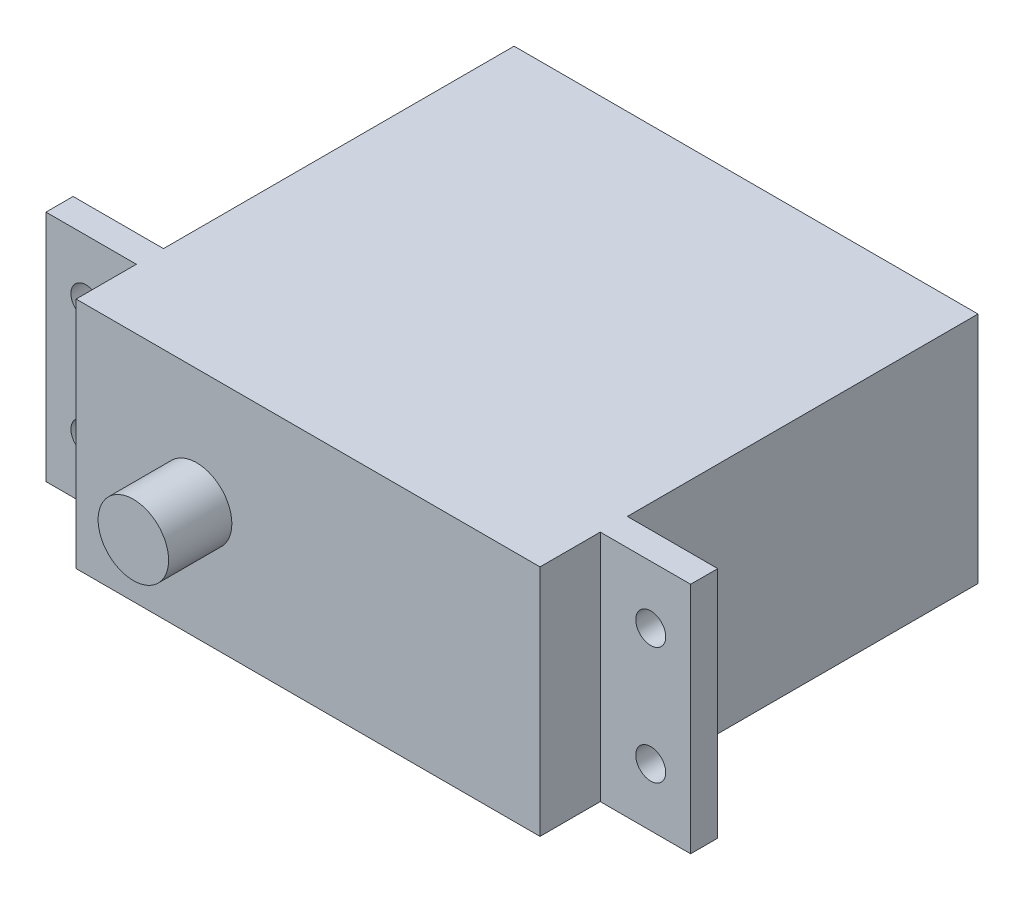
ISO-10303-21;
HEADER;
FILE_DESCRIPTION(('STEP AP214'),'2;1');
FILE_NAME('part.step','',(''),(''),'','','');
FILE_SCHEMA(('AUTOMOTIVE_DESIGN { 1 0 10303 214 1 1 1 1 }'));
ENDSEC;
DATA;
#1=APPLICATION_CONTEXT('core data for automotive mechanical design processes');
#2=APPLICATION_PROTOCOL_DEFINITION('international standard','automotive_design',2000,#1);
#3=PRODUCT_CONTEXT('',#1,'mechanical');
#4=PRODUCT('Part','Part','',(#3));
#5=PRODUCT_RELATED_PRODUCT_CATEGORY('part','',(#4));
#6=PRODUCT_DEFINITION_FORMATION('','',#4);
#7=PRODUCT_DEFINITION_CONTEXT('part definition',#1,'design');
#8=PRODUCT_DEFINITION('design','',#6,#7);
#9=PRODUCT_DEFINITION_SHAPE('','',#8);
#10=(LENGTH_UNIT() NAMED_UNIT(*) SI_UNIT(.MILLI.,.METRE.));
#11=(NAMED_UNIT(*) PLANE_ANGLE_UNIT() SI_UNIT($,.RADIAN.));
#12=(NAMED_UNIT(*) SI_UNIT($,.STERADIAN.) SOLID_ANGLE_UNIT());
#13=UNCERTAINTY_MEASURE_WITH_UNIT(LENGTH_MEASURE(1.E-05),#10,'distance_accuracy_value','');
#14=(GEOMETRIC_REPRESENTATION_CONTEXT(3) GLOBAL_UNCERTAINTY_ASSIGNED_CONTEXT((#13)) GLOBAL_UNIT_ASSIGNED_CONTEXT((#10,
#11,#12)) REPRESENTATION_CONTEXT('',''));
#15=CARTESIAN_POINT('',(0.,0.,0.));
#16=DIRECTION('',(0.,0.,1.));
#17=DIRECTION('',(1.,0.,0.));
#18=AXIS2_PLACEMENT_3D('',#15,#16,#17);
#19=CARTESIAN_POINT('',(-27.178,-9.8425,42.2656));
#20=DIRECTION('',(1.,0.,0.));
#21=DIRECTION('',(0.,1.,0.));
#22=AXIS2_PLACEMENT_3D('',#19,#20,#21);
#23=PLANE('',#22);
#24=DIRECTION('',(0.,1.,0.));
#25=VECTOR('',#24,1.);
#26=CARTESIAN_POINT('',(-27.178,9.89648854594805,29.5656));
#27=LINE('',#26,#25);
#28=CARTESIAN_POINT('',(-27.178,-9.8425,29.5656));
#29=VERTEX_POINT('',#28);
#30=CARTESIAN_POINT('',(-27.178,9.8425,29.5656));
#31=VERTEX_POINT('',#30);
#32=EDGE_CURVE('E204',#29,#31,#27,.T.);
#33=ORIENTED_EDGE('',*,*,#32,.F.);
#34=DIRECTION('',(0.,0.,-1.));
#35=VECTOR('',#34,1.);
#36=CARTESIAN_POINT('',(-27.178,-9.8425,42.2656));
#37=LINE('',#36,#35);
#38=CARTESIAN_POINT('',(-27.178,-9.8425,31.8516));
#39=VERTEX_POINT('',#38);
#40=EDGE_CURVE('E148',#39,#29,#37,.T.);
#41=ORIENTED_EDGE('',*,*,#40,.F.);
#42=DIRECTION('',(0.,-1.,0.));
#43=VECTOR('',#42,1.);
#44=CARTESIAN_POINT('',(-27.178,-9.95965837324774,31.8516));
#45=LINE('',#44,#43);
#46=CARTESIAN_POINT('',(-27.178,9.8425,31.8516));
#47=VERTEX_POINT('',#46);
#48=EDGE_CURVE('E216',#47,#39,#45,.T.);
#49=ORIENTED_EDGE('',*,*,#48,.F.);
#50=DIRECTION('',(0.,0.,-1.));
#51=VECTOR('',#50,1.);
#52=CARTESIAN_POINT('',(-27.178,9.8425,42.2656));
#53=LINE('',#52,#51);
#54=EDGE_CURVE('E146',#47,#31,#53,.T.);
#55=ORIENTED_EDGE('',*,*,#54,.T.);
#56=EDGE_LOOP('',(#33,#41,#49,#55));
#57=FACE_BOUND('',#56,.T.);
#58=ADVANCED_FACE('F34',(#57),#23,.F.);
#59=CARTESIAN_POINT('',(-27.178,-9.8425,42.2656));
#60=DIRECTION('',(0.,1.,0.));
#61=DIRECTION('',(0.,0.,1.));
#62=AXIS2_PLACEMENT_3D('',#59,#60,#61);
#63=PLANE('',#62);
#64=DIRECTION('',(1.,0.,0.));
#65=VECTOR('',#64,1.);
#66=CARTESIAN_POINT('',(-27.178,-9.8425,0.));
#67=LINE('',#66,#65);
#68=CARTESIAN_POINT('',(-19.558,-9.8425,0.));
#69=VERTEX_POINT('',#68);
#70=CARTESIAN_POINT('',(19.558,-9.8425,0.));
#71=VERTEX_POINT('',#70);
#72=EDGE_CURVE('E247',#69,#71,#67,.T.);
#73=ORIENTED_EDGE('',*,*,#72,.T.);
#74=DIRECTION('',(0.,0.,1.));
#75=VECTOR('',#74,1.);
#76=CARTESIAN_POINT('',(19.558,-9.8425,42.2656));
#77=LINE('',#76,#75);
#78=CARTESIAN_POINT('',(19.558,-9.8425,29.5656));
#79=VERTEX_POINT('',#78);
#80=EDGE_CURVE('E50',#71,#79,#77,.T.);
#81=ORIENTED_EDGE('',*,*,#80,.T.);
#82=DIRECTION('',(1.,0.,0.));
#83=VECTOR('',#82,1.);
#84=CARTESIAN_POINT('',(-27.178,-9.8425,29.5656));
#85=LINE('',#84,#83);
#86=CARTESIAN_POINT('',(27.178,-9.8425,29.5656));
#87=VERTEX_POINT('',#86);
#88=EDGE_CURVE('E199',#79,#87,#85,.T.);
#89=ORIENTED_EDGE('',*,*,#88,.T.);
#90=DIRECTION('',(0.,0.,-1.));
#91=VECTOR('',#90,1.);
#92=CARTESIAN_POINT('',(27.178,-9.8425,42.2656));
#93=LINE('',#92,#91);
#94=CARTESIAN_POINT('',(27.178,-9.8425,31.8516));
#95=VERTEX_POINT('',#94);
#96=EDGE_CURVE('E139',#95,#87,#93,.T.);
#97=ORIENTED_EDGE('',*,*,#96,.F.);
#98=DIRECTION('',(-1.,0.,0.));
#99=VECTOR('',#98,1.);
#100=CARTESIAN_POINT('',(-27.178,-9.8425,31.8516));
#101=LINE('',#100,#99);
#102=CARTESIAN_POINT('',(19.558,-9.8425,31.8516));
#103=VERTEX_POINT('',#102);
#104=EDGE_CURVE('E236',#95,#103,#101,.T.);
#105=ORIENTED_EDGE('',*,*,#104,.T.);
#106=DIRECTION('',(0.,0.,1.));
#107=VECTOR('',#106,1.);
#108=CARTESIAN_POINT('',(19.558,-9.8425,42.2656));
#109=LINE('',#108,#107);
#110=CARTESIAN_POINT('',(19.558,-9.8425,36.9316));
#111=VERTEX_POINT('',#110);
#112=EDGE_CURVE('E233',#103,#111,#109,.T.);
#113=ORIENTED_EDGE('',*,*,#112,.T.);
#114=DIRECTION('',(1.,0.,0.));
#115=VECTOR('',#114,1.);
#116=CARTESIAN_POINT('',(-27.178,-9.8425,36.9316));
#117=LINE('',#116,#115);
#118=CARTESIAN_POINT('',(-19.558,-9.8425,36.9316));
#119=VERTEX_POINT('',#118);
#120=EDGE_CURVE('E243',#119,#111,#117,.T.);
#121=ORIENTED_EDGE('',*,*,#120,.F.);
#122=DIRECTION('',(0.,0.,-1.));
#123=VECTOR('',#122,1.);
#124=CARTESIAN_POINT('',(-19.558,-9.8425,42.2656));
#125=LINE('',#124,#123);
#126=CARTESIAN_POINT('',(-19.558,-9.8425,31.8516));
#127=VERTEX_POINT('',#126);
#128=EDGE_CURVE('E221',#119,#127,#125,.T.);
#129=ORIENTED_EDGE('',*,*,#128,.T.);
#130=DIRECTION('',(1.,0.,0.));
#131=VECTOR('',#130,1.);
#132=CARTESIAN_POINT('',(-27.178,-9.8425,31.8516));
#133=LINE('',#132,#131);
#134=EDGE_CURVE('E224',#39,#127,#133,.T.);
#135=ORIENTED_EDGE('',*,*,#134,.F.);
#136=ORIENTED_EDGE('',*,*,#40,.T.);
#137=DIRECTION('',(-1.,0.,0.));
#138=VECTOR('',#137,1.);
#139=CARTESIAN_POINT('',(-27.178,-9.8425,29.5656));
#140=LINE('',#139,#138);
#141=CARTESIAN_POINT('',(-19.558,-9.8425,29.5656));
#142=VERTEX_POINT('',#141);
#143=EDGE_CURVE('E211',#142,#29,#140,.T.);
#144=ORIENTED_EDGE('',*,*,#143,.F.);
#145=DIRECTION('',(0.,0.,-1.));
#146=VECTOR('',#145,1.);
#147=CARTESIAN_POINT('',(-19.558,-9.8425,42.2656));
#148=LINE('',#147,#146);
#149=EDGE_CURVE('E208',#142,#69,#148,.T.);
#150=ORIENTED_EDGE('',*,*,#149,.T.);
#151=EDGE_LOOP('',(#73,#81,#89,#97,#105,#113,#121,#129,#135,#136,#144,#150));
#152=FACE_BOUND('',#151,.T.);
#153=ADVANCED_FACE('F251',(#152),#63,.F.);
#154=CARTESIAN_POINT('',(27.178,-9.8425,42.2656));
#155=DIRECTION('',(-1.,0.,0.));
#156=DIRECTION('',(0.,-1.,0.));
#157=AXIS2_PLACEMENT_3D('',#154,#155,#156);
#158=PLANE('',#157);
#159=ORIENTED_EDGE('',*,*,#96,.T.);
#160=DIRECTION('',(0.,-1.,0.));
#161=VECTOR('',#160,1.);
#162=CARTESIAN_POINT('',(27.178,9.9934184525239,29.5656));
#163=LINE('',#162,#161);
#164=CARTESIAN_POINT('',(27.178,9.84250000000001,29.5656));
#165=VERTEX_POINT('',#164);
#166=EDGE_CURVE('E128',#165,#87,#163,.T.);
#167=ORIENTED_EDGE('',*,*,#166,.F.);
#168=DIRECTION('',(0.,0.,-1.));
#169=VECTOR('',#168,1.);
#170=CARTESIAN_POINT('',(27.178,9.84250000000001,42.2656));
#171=LINE('',#170,#169);
#172=CARTESIAN_POINT('',(27.178,9.84250000000001,31.8516));
#173=VERTEX_POINT('',#172);
#174=EDGE_CURVE('E137',#173,#165,#171,.T.);
#175=ORIENTED_EDGE('',*,*,#174,.F.);
#176=DIRECTION('',(0.,1.,0.));
#177=VECTOR('',#176,1.);
#178=CARTESIAN_POINT('',(27.178,-10.1678865434564,31.8516));
#179=LINE('',#178,#177);
#180=EDGE_CURVE('E229',#95,#173,#179,.T.);
#181=ORIENTED_EDGE('',*,*,#180,.F.);
#182=EDGE_LOOP('',(#159,#167,#175,#181));
#183=FACE_BOUND('',#182,.T.);
#184=ADVANCED_FACE('F135',(#183),#158,.F.);
#185=CARTESIAN_POINT('',(-27.178,9.8425,42.2656));
#186=DIRECTION('',(0.,-1.,0.));
#187=DIRECTION('',(1.,0.,0.));
#188=AXIS2_PLACEMENT_3D('',#185,#186,#187);
#189=PLANE('',#188);
#190=DIRECTION('',(-1.,0.,0.));
#191=VECTOR('',#190,1.);
#192=CARTESIAN_POINT('',(-27.178,9.8425,29.5656));
#193=LINE('',#192,#191);
#194=CARTESIAN_POINT('',(19.558,9.84250000000001,29.5656));
#195=VERTEX_POINT('',#194);
#196=EDGE_CURVE('E12',#165,#195,#193,.T.);
#197=ORIENTED_EDGE('',*,*,#196,.T.);
#198=DIRECTION('',(0.,0.,-1.));
#199=VECTOR('',#198,1.);
#200=CARTESIAN_POINT('',(19.558,9.84250000000001,42.2656));
#201=LINE('',#200,#199);
#202=CARTESIAN_POINT('',(19.558,9.84250000000001,0.));
#203=VERTEX_POINT('',#202);
#204=EDGE_CURVE('E140',#195,#203,#201,.T.);
#205=ORIENTED_EDGE('',*,*,#204,.T.);
#206=DIRECTION('',(-1.,0.,0.));
#207=VECTOR('',#206,1.);
#208=CARTESIAN_POINT('',(-27.178,9.8425,0.));
#209=LINE('',#208,#207);
#210=CARTESIAN_POINT('',(-19.558,9.8425,0.));
#211=VERTEX_POINT('',#210);
#212=EDGE_CURVE('E58',#203,#211,#209,.T.);
#213=ORIENTED_EDGE('',*,*,#212,.T.);
#214=DIRECTION('',(0.,0.,1.));
#215=VECTOR('',#214,1.);
#216=CARTESIAN_POINT('',(-19.558,9.8425,42.2656));
#217=LINE('',#216,#215);
#218=CARTESIAN_POINT('',(-19.558,9.8425,29.5656));
#219=VERTEX_POINT('',#218);
#220=EDGE_CURVE('E206',#211,#219,#217,.T.);
#221=ORIENTED_EDGE('',*,*,#220,.T.);
#222=DIRECTION('',(1.,0.,0.));
#223=VECTOR('',#222,1.);
#224=CARTESIAN_POINT('',(-27.178,9.8425,29.5656));
#225=LINE('',#224,#223);
#226=EDGE_CURVE('E169',#31,#219,#225,.T.);
#227=ORIENTED_EDGE('',*,*,#226,.F.);
#228=ORIENTED_EDGE('',*,*,#54,.F.);
#229=DIRECTION('',(-1.,0.,0.));
#230=VECTOR('',#229,1.);
#231=CARTESIAN_POINT('',(-27.178,9.8425,31.8516));
#232=LINE('',#231,#230);
#233=CARTESIAN_POINT('',(-19.558,9.8425,31.8516));
#234=VERTEX_POINT('',#233);
#235=EDGE_CURVE('E165',#234,#47,#232,.T.);
#236=ORIENTED_EDGE('',*,*,#235,.F.);
#237=DIRECTION('',(0.,0.,1.));
#238=VECTOR('',#237,1.);
#239=CARTESIAN_POINT('',(-19.558,9.8425,42.2656));
#240=LINE('',#239,#238);
#241=CARTESIAN_POINT('',(-19.558,9.84250000000001,36.9316));
#242=VERTEX_POINT('',#241);
#243=EDGE_CURVE('E218',#234,#242,#240,.T.);
#244=ORIENTED_EDGE('',*,*,#243,.T.);
#245=DIRECTION('',(-1.,0.,0.));
#246=VECTOR('',#245,1.);
#247=CARTESIAN_POINT('',(-27.178,9.8425,36.9316));
#248=LINE('',#247,#246);
#249=CARTESIAN_POINT('',(19.558,9.84250000000001,36.9316));
#250=VERTEX_POINT('',#249);
#251=EDGE_CURVE('E156',#250,#242,#248,.T.);
#252=ORIENTED_EDGE('',*,*,#251,.F.);
#253=DIRECTION('',(0.,0.,-1.));
#254=VECTOR('',#253,1.);
#255=CARTESIAN_POINT('',(19.558,9.84250000000001,42.2656));
#256=LINE('',#255,#254);
#257=CARTESIAN_POINT('',(19.558,9.84250000000001,31.8516));
#258=VERTEX_POINT('',#257);
#259=EDGE_CURVE('E231',#250,#258,#256,.T.);
#260=ORIENTED_EDGE('',*,*,#259,.T.);
#261=DIRECTION('',(1.,0.,0.));
#262=VECTOR('',#261,1.);
#263=CARTESIAN_POINT('',(-27.178,9.8425,31.8516));
#264=LINE('',#263,#262);
#265=EDGE_CURVE('E145',#258,#173,#264,.T.);
#266=ORIENTED_EDGE('',*,*,#265,.T.);
#267=ORIENTED_EDGE('',*,*,#174,.T.);
#268=EDGE_LOOP('',(#197,#205,#213,#221,#227,#228,#236,#244,#252,#260,#266,#267));
#269=FACE_BOUND('',#268,.T.);
#270=ADVANCED_FACE('F143',(#269),#189,.F.);
#271=CARTESIAN_POINT('',(-27.178,9.8425,0.));
#272=DIRECTION('',(0.,0.,-1.));
#273=DIRECTION('',(-1.,0.,0.));
#274=AXIS2_PLACEMENT_3D('',#271,#272,#273);
#275=PLANE('',#274);
#276=DIRECTION('',(0.,1.,0.));
#277=VECTOR('',#276,1.);
#278=CARTESIAN_POINT('',(19.558,9.84250000000004,0.));
#279=LINE('',#278,#277);
#280=EDGE_CURVE('E42',#71,#203,#279,.T.);
#281=ORIENTED_EDGE('',*,*,#280,.F.);
#282=ORIENTED_EDGE('',*,*,#72,.F.);
#283=DIRECTION('',(0.,-1.,0.));
#284=VECTOR('',#283,1.);
#285=CARTESIAN_POINT('',(-19.558,9.8425,0.));
#286=LINE('',#285,#284);
#287=EDGE_CURVE('E167',#211,#69,#286,.T.);
#288=ORIENTED_EDGE('',*,*,#287,.F.);
#289=ORIENTED_EDGE('',*,*,#212,.F.);
#290=EDGE_LOOP('',(#281,#282,#288,#289));
#291=FACE_BOUND('',#290,.T.);
#292=ADVANCED_FACE('F255',(#291),#275,.T.);
#293=CARTESIAN_POINT('',(0.,0.,36.9316));
#294=DIRECTION('',(0.,0.,1.));
#295=DIRECTION('',(1.,0.,0.));
#296=AXIS2_PLACEMENT_3D('',#293,#294,#295);
#297=PLANE('',#296);
#298=DIRECTION('',(0.,1.,0.));
#299=VECTOR('',#298,1.);
#300=CARTESIAN_POINT('',(-19.558,0.,36.9316));
#301=LINE('',#300,#299);
#302=EDGE_CURVE('E163',#119,#242,#301,.T.);
#303=ORIENTED_EDGE('',*,*,#302,.F.);
#304=ORIENTED_EDGE('',*,*,#120,.T.);
#305=DIRECTION('',(0.,-1.,0.));
#306=VECTOR('',#305,1.);
#307=CARTESIAN_POINT('',(19.558,0.,36.9316));
#308=LINE('',#307,#306);
#309=EDGE_CURVE('E159',#250,#111,#308,.T.);
#310=ORIENTED_EDGE('',*,*,#309,.F.);
#311=ORIENTED_EDGE('',*,*,#251,.T.);
#312=EDGE_LOOP('',(#303,#304,#310,#311));
#313=FACE_BOUND('',#312,.T.);
#314=CARTESIAN_POINT('',(-9.39800000000001,0.,36.9316));
#315=DIRECTION('',(0.,0.,1.));
#316=DIRECTION('',(1.,0.,0.));
#317=AXIS2_PLACEMENT_3D('',#314,#315,#316);
#318=CIRCLE('',#317,2.9718);
#319=CARTESIAN_POINT('',(-6.42620000000001,0.,36.9316));
#320=VERTEX_POINT('',#319);
#321=EDGE_CURVE('E240',#320,#320,#318,.T.);
#322=ORIENTED_EDGE('',*,*,#321,.F.);
#323=EDGE_LOOP('',(#322));
#324=FACE_BOUND('',#323,.T.);
#325=ADVANCED_FACE('F294',(#313,#324),#297,.T.);
#326=CARTESIAN_POINT('',(-9.39800000000001,0.,36.9316));
#327=DIRECTION('',(0.,0.,1.));
#328=DIRECTION('',(1.,0.,0.));
#329=AXIS2_PLACEMENT_3D('',#326,#327,#328);
#330=CYLINDRICAL_SURFACE('',#329,2.9718);
#331=ORIENTED_EDGE('',*,*,#321,.T.);
#332=EDGE_LOOP('',(#331));
#333=FACE_BOUND('',#332,.T.);
#334=CARTESIAN_POINT('',(-9.39800000000001,0.,42.2656));
#335=DIRECTION('',(0.,0.,1.));
#336=DIRECTION('',(1.,0.,0.));
#337=AXIS2_PLACEMENT_3D('',#334,#335,#336);
#338=CIRCLE('',#337,2.9718);
#339=CARTESIAN_POINT('',(-6.42620000000001,0.,42.2656));
#340=VERTEX_POINT('',#339);
#341=EDGE_CURVE('E239',#340,#340,#338,.T.);
#342=ORIENTED_EDGE('',*,*,#341,.F.);
#343=EDGE_LOOP('',(#342));
#344=FACE_BOUND('',#343,.T.);
#345=ADVANCED_FACE('F310',(#333,#344),#330,.T.);
#346=CARTESIAN_POINT('',(-27.178,9.8425,42.2656));
#347=DIRECTION('',(0.,0.,-1.));
#348=DIRECTION('',(-1.,0.,0.));
#349=AXIS2_PLACEMENT_3D('',#346,#347,#348);
#350=PLANE('',#349);
#351=ORIENTED_EDGE('',*,*,#341,.T.);
#352=EDGE_LOOP('',(#351));
#353=FACE_BOUND('',#352,.T.);
#354=ADVANCED_FACE('F302',(#353),#350,.F.);
#355=CARTESIAN_POINT('',(19.558,10.1678865434564,31.8516));
#356=DIRECTION('',(0.,0.,-1.));
#357=DIRECTION('',(-1.,0.,0.));
#358=AXIS2_PLACEMENT_3D('',#355,#356,#357);
#359=PLANE('',#358);
#360=CARTESIAN_POINT('',(23.8125,4.953,31.8516));
#361=DIRECTION('',(0.,0.,1.));
#362=DIRECTION('',(1.,0.,0.));
#363=AXIS2_PLACEMENT_3D('',#360,#361,#362);
#364=CIRCLE('',#363,1.26364999999999);
#365=CARTESIAN_POINT('',(25.07615,4.953,31.8516));
#366=VERTEX_POINT('',#365);
#367=EDGE_CURVE('E178',#366,#366,#364,.T.);
#368=ORIENTED_EDGE('',*,*,#367,.F.);
#369=EDGE_LOOP('',(#368));
#370=FACE_BOUND('',#369,.T.);
#371=CARTESIAN_POINT('',(23.8125,-4.953,31.8516));
#372=DIRECTION('',(0.,0.,1.));
#373=DIRECTION('',(1.,0.,0.));
#374=AXIS2_PLACEMENT_3D('',#371,#372,#373);
#375=CIRCLE('',#374,1.26364999999999);
#376=CARTESIAN_POINT('',(25.07615,-4.953,31.8516));
#377=VERTEX_POINT('',#376);
#378=EDGE_CURVE('E175',#377,#377,#375,.T.);
#379=ORIENTED_EDGE('',*,*,#378,.F.);
#380=EDGE_LOOP('',(#379));
#381=FACE_BOUND('',#380,.T.);
#382=ORIENTED_EDGE('',*,*,#180,.T.);
#383=ORIENTED_EDGE('',*,*,#265,.F.);
#384=DIRECTION('',(0.,-1.,0.));
#385=VECTOR('',#384,1.);
#386=CARTESIAN_POINT('',(19.558,-10.1678865434565,31.8516));
#387=LINE('',#386,#385);
#388=EDGE_CURVE('E226',#258,#103,#387,.T.);
#389=ORIENTED_EDGE('',*,*,#388,.T.);
#390=ORIENTED_EDGE('',*,*,#104,.F.);
#391=EDGE_LOOP('',(#382,#383,#389,#390));
#392=FACE_BOUND('',#391,.T.);
#393=ADVANCED_FACE('F300',(#370,#381,#392),#359,.F.);
#394=CARTESIAN_POINT('',(19.558,-10.1678865434565,31.8516));
#395=DIRECTION('',(-1.,0.,0.));
#396=DIRECTION('',(0.,-1.,0.));
#397=AXIS2_PLACEMENT_3D('',#394,#395,#396);
#398=PLANE('',#397);
#399=ORIENTED_EDGE('',*,*,#388,.F.);
#400=ORIENTED_EDGE('',*,*,#259,.F.);
#401=ORIENTED_EDGE('',*,*,#309,.T.);
#402=ORIENTED_EDGE('',*,*,#112,.F.);
#403=EDGE_LOOP('',(#399,#400,#401,#402));
#404=FACE_BOUND('',#403,.T.);
#405=ADVANCED_FACE('F298',(#404),#398,.F.);
#406=CARTESIAN_POINT('',(-19.558,9.95965837324774,31.8516));
#407=DIRECTION('',(0.,0.,1.));
#408=DIRECTION('',(1.,0.,0.));
#409=AXIS2_PLACEMENT_3D('',#406,#407,#408);
#410=PLANE('',#409);
#411=CARTESIAN_POINT('',(-23.8125,4.953,31.8516));
#412=DIRECTION('',(0.,0.,1.));
#413=DIRECTION('',(1.,0.,0.));
#414=AXIS2_PLACEMENT_3D('',#411,#412,#413);
#415=CIRCLE('',#414,1.26364999999999);
#416=CARTESIAN_POINT('',(-22.54885,4.953,31.8516));
#417=VERTEX_POINT('',#416);
#418=EDGE_CURVE('E191',#417,#417,#415,.T.);
#419=ORIENTED_EDGE('',*,*,#418,.F.);
#420=EDGE_LOOP('',(#419));
#421=FACE_BOUND('',#420,.T.);
#422=CARTESIAN_POINT('',(-23.8125,-4.953,31.8516));
#423=DIRECTION('',(0.,0.,1.));
#424=DIRECTION('',(1.,0.,0.));
#425=AXIS2_PLACEMENT_3D('',#422,#423,#424);
#426=CIRCLE('',#425,1.26364999999999);
#427=CARTESIAN_POINT('',(-22.54885,-4.953,31.8516));
#428=VERTEX_POINT('',#427);
#429=EDGE_CURVE('E181',#428,#428,#426,.T.);
#430=ORIENTED_EDGE('',*,*,#429,.F.);
#431=EDGE_LOOP('',(#430));
#432=FACE_BOUND('',#431,.T.);
#433=ORIENTED_EDGE('',*,*,#134,.T.);
#434=DIRECTION('',(0.,1.,0.));
#435=VECTOR('',#434,1.);
#436=CARTESIAN_POINT('',(-19.558,-9.95965837324774,31.8516));
#437=LINE('',#436,#435);
#438=EDGE_CURVE('E213',#127,#234,#437,.T.);
#439=ORIENTED_EDGE('',*,*,#438,.T.);
#440=ORIENTED_EDGE('',*,*,#235,.T.);
#441=ORIENTED_EDGE('',*,*,#48,.T.);
#442=EDGE_LOOP('',(#433,#439,#440,#441));
#443=FACE_BOUND('',#442,.T.);
#444=ADVANCED_FACE('F286',(#421,#432,#443),#410,.T.);
#445=CARTESIAN_POINT('',(-19.558,-9.95965837324774,31.8516));
#446=DIRECTION('',(1.,0.,0.));
#447=DIRECTION('',(0.,1.,0.));
#448=AXIS2_PLACEMENT_3D('',#445,#446,#447);
#449=PLANE('',#448);
#450=ORIENTED_EDGE('',*,*,#302,.T.);
#451=ORIENTED_EDGE('',*,*,#243,.F.);
#452=ORIENTED_EDGE('',*,*,#438,.F.);
#453=ORIENTED_EDGE('',*,*,#128,.F.);
#454=EDGE_LOOP('',(#450,#451,#452,#453));
#455=FACE_BOUND('',#454,.T.);
#456=ADVANCED_FACE('F289',(#455),#449,.F.);
#457=CARTESIAN_POINT('',(-19.558,-9.89648854594805,29.5656));
#458=DIRECTION('',(0.,0.,-1.));
#459=DIRECTION('',(-1.,0.,0.));
#460=AXIS2_PLACEMENT_3D('',#457,#458,#459);
#461=PLANE('',#460);
#462=CARTESIAN_POINT('',(-23.8125,4.953,29.5656));
#463=DIRECTION('',(0.,0.,-1.));
#464=DIRECTION('',(-1.,0.,0.));
#465=AXIS2_PLACEMENT_3D('',#462,#463,#464);
#466=CIRCLE('',#465,1.26364999999999);
#467=CARTESIAN_POINT('',(-25.07615,4.953,29.5656));
#468=VERTEX_POINT('',#467);
#469=EDGE_CURVE('E37',#468,#468,#466,.T.);
#470=ORIENTED_EDGE('',*,*,#469,.F.);
#471=EDGE_LOOP('',(#470));
#472=FACE_BOUND('',#471,.T.);
#473=CARTESIAN_POINT('',(-23.8125,-4.953,29.5656));
#474=DIRECTION('',(0.,0.,-1.));
#475=DIRECTION('',(-1.,0.,0.));
#476=AXIS2_PLACEMENT_3D('',#473,#474,#475);
#477=CIRCLE('',#476,1.26364999999999);
#478=CARTESIAN_POINT('',(-25.07615,-4.953,29.5656));
#479=VERTEX_POINT('',#478);
#480=EDGE_CURVE('E179',#479,#479,#477,.T.);
#481=ORIENTED_EDGE('',*,*,#480,.F.);
#482=EDGE_LOOP('',(#481));
#483=FACE_BOUND('',#482,.T.);
#484=ORIENTED_EDGE('',*,*,#143,.T.);
#485=ORIENTED_EDGE('',*,*,#32,.T.);
#486=ORIENTED_EDGE('',*,*,#226,.T.);
#487=DIRECTION('',(0.,-1.,0.));
#488=VECTOR('',#487,1.);
#489=CARTESIAN_POINT('',(-19.558,9.89648854594805,29.5656));
#490=LINE('',#489,#488);
#491=EDGE_CURVE('E201',#219,#142,#490,.T.);
#492=ORIENTED_EDGE('',*,*,#491,.T.);
#493=EDGE_LOOP('',(#484,#485,#486,#492));
#494=FACE_BOUND('',#493,.T.);
#495=ADVANCED_FACE('F394',(#472,#483,#494),#461,.T.);
#496=CARTESIAN_POINT('',(-19.558,9.89648854594805,29.5656));
#497=DIRECTION('',(1.,0.,0.));
#498=DIRECTION('',(0.,1.,0.));
#499=AXIS2_PLACEMENT_3D('',#496,#497,#498);
#500=PLANE('',#499);
#501=ORIENTED_EDGE('',*,*,#491,.F.);
#502=ORIENTED_EDGE('',*,*,#220,.F.);
#503=ORIENTED_EDGE('',*,*,#287,.T.);
#504=ORIENTED_EDGE('',*,*,#149,.F.);
#505=EDGE_LOOP('',(#501,#502,#503,#504));
#506=FACE_BOUND('',#505,.T.);
#507=ADVANCED_FACE('F267',(#506),#500,.F.);
#508=CARTESIAN_POINT('',(19.558,-9.99341845252389,29.5656));
#509=DIRECTION('',(0.,0.,1.));
#510=DIRECTION('',(1.,0.,0.));
#511=AXIS2_PLACEMENT_3D('',#508,#509,#510);
#512=PLANE('',#511);
#513=CARTESIAN_POINT('',(23.8125,4.953,29.5656));
#514=DIRECTION('',(0.,0.,1.));
#515=DIRECTION('',(1.,0.,0.));
#516=AXIS2_PLACEMENT_3D('',#513,#514,#515);
#517=CIRCLE('',#516,1.26364999999999);
#518=CARTESIAN_POINT('',(25.07615,4.953,29.5656));
#519=VERTEX_POINT('',#518);
#520=EDGE_CURVE('E176',#519,#519,#517,.T.);
#521=ORIENTED_EDGE('',*,*,#520,.T.);
#522=EDGE_LOOP('',(#521));
#523=FACE_BOUND('',#522,.T.);
#524=CARTESIAN_POINT('',(23.8125,-4.953,29.5656));
#525=DIRECTION('',(0.,0.,1.));
#526=DIRECTION('',(1.,0.,0.));
#527=AXIS2_PLACEMENT_3D('',#524,#525,#526);
#528=CIRCLE('',#527,1.26364999999999);
#529=CARTESIAN_POINT('',(25.07615,-4.953,29.5656));
#530=VERTEX_POINT('',#529);
#531=EDGE_CURVE('E172',#530,#530,#528,.T.);
#532=ORIENTED_EDGE('',*,*,#531,.T.);
#533=EDGE_LOOP('',(#532));
#534=FACE_BOUND('',#533,.T.);
#535=DIRECTION('',(0.,1.,0.));
#536=VECTOR('',#535,1.);
#537=CARTESIAN_POINT('',(19.558,9.99341845252389,29.5656));
#538=LINE('',#537,#536);
#539=EDGE_CURVE('E130',#79,#195,#538,.T.);
#540=ORIENTED_EDGE('',*,*,#539,.T.);
#541=ORIENTED_EDGE('',*,*,#196,.F.);
#542=ORIENTED_EDGE('',*,*,#166,.T.);
#543=ORIENTED_EDGE('',*,*,#88,.F.);
#544=EDGE_LOOP('',(#540,#541,#542,#543));
#545=FACE_BOUND('',#544,.T.);
#546=ADVANCED_FACE('F127',(#523,#534,#545),#512,.F.);
#547=CARTESIAN_POINT('',(19.558,9.99341845252389,29.5656));
#548=DIRECTION('',(-1.,0.,0.));
#549=DIRECTION('',(0.,-1.,0.));
#550=AXIS2_PLACEMENT_3D('',#547,#548,#549);
#551=PLANE('',#550);
#552=ORIENTED_EDGE('',*,*,#280,.T.);
#553=ORIENTED_EDGE('',*,*,#204,.F.);
#554=ORIENTED_EDGE('',*,*,#539,.F.);
#555=ORIENTED_EDGE('',*,*,#80,.F.);
#556=EDGE_LOOP('',(#552,#553,#554,#555));
#557=FACE_BOUND('',#556,.T.);
#558=ADVANCED_FACE('F256',(#557),#551,.F.);
#559=CARTESIAN_POINT('',(23.8125,-4.953,31.8516));
#560=DIRECTION('',(0.,0.,1.));
#561=DIRECTION('',(1.,0.,0.));
#562=AXIS2_PLACEMENT_3D('',#559,#560,#561);
#563=CYLINDRICAL_SURFACE('',#562,1.26364999999999);
#564=ORIENTED_EDGE('',*,*,#378,.T.);
#565=EDGE_LOOP('',(#564));
#566=FACE_BOUND('',#565,.T.);
#567=ORIENTED_EDGE('',*,*,#531,.F.);
#568=EDGE_LOOP('',(#567));
#569=FACE_BOUND('',#568,.T.);
#570=ADVANCED_FACE('F258',(#566,#569),#563,.F.);
#571=CARTESIAN_POINT('',(23.8125,4.953,31.8516));
#572=DIRECTION('',(0.,0.,1.));
#573=DIRECTION('',(1.,0.,0.));
#574=AXIS2_PLACEMENT_3D('',#571,#572,#573);
#575=CYLINDRICAL_SURFACE('',#574,1.26364999999999);
#576=ORIENTED_EDGE('',*,*,#367,.T.);
#577=EDGE_LOOP('',(#576));
#578=FACE_BOUND('',#577,.T.);
#579=ORIENTED_EDGE('',*,*,#520,.F.);
#580=EDGE_LOOP('',(#579));
#581=FACE_BOUND('',#580,.T.);
#582=ADVANCED_FACE('F264',(#578,#581),#575,.F.);
#583=CARTESIAN_POINT('',(-23.8125,-4.953,31.8516));
#584=DIRECTION('',(0.,0.,1.));
#585=DIRECTION('',(1.,0.,0.));
#586=AXIS2_PLACEMENT_3D('',#583,#584,#585);
#587=CYLINDRICAL_SURFACE('',#586,1.26364999999999);
#588=ORIENTED_EDGE('',*,*,#480,.T.);
#589=EDGE_LOOP('',(#588));
#590=FACE_BOUND('',#589,.T.);
#591=ORIENTED_EDGE('',*,*,#429,.T.);
#592=EDGE_LOOP('',(#591));
#593=FACE_BOUND('',#592,.T.);
#594=ADVANCED_FACE('F432',(#590,#593),#587,.F.);
#595=CARTESIAN_POINT('',(-23.8125,4.953,31.8516));
#596=DIRECTION('',(0.,0.,1.));
#597=DIRECTION('',(1.,0.,0.));
#598=AXIS2_PLACEMENT_3D('',#595,#596,#597);
#599=CYLINDRICAL_SURFACE('',#598,1.26364999999999);
#600=ORIENTED_EDGE('',*,*,#469,.T.);
#601=EDGE_LOOP('',(#600));
#602=FACE_BOUND('',#601,.T.);
#603=ORIENTED_EDGE('',*,*,#418,.T.);
#604=EDGE_LOOP('',(#603));
#605=FACE_BOUND('',#604,.T.);
#606=ADVANCED_FACE('F441',(#602,#605),#599,.F.);
#607=CLOSED_SHELL('',(#58,#153,#184,#270,#292,#325,#345,#354,#393,#405,#444,#456,#495,#507,#546,
#558,#570,#582,#594,#606));
#608=MANIFOLD_SOLID_BREP('B2',#607);
#609=ADVANCED_BREP_SHAPE_REPRESENTATION('',(#18,#608),#14);
#610=SHAPE_DEFINITION_REPRESENTATION(#9,#609);
ENDSEC;
END-ISO-10303-21;
